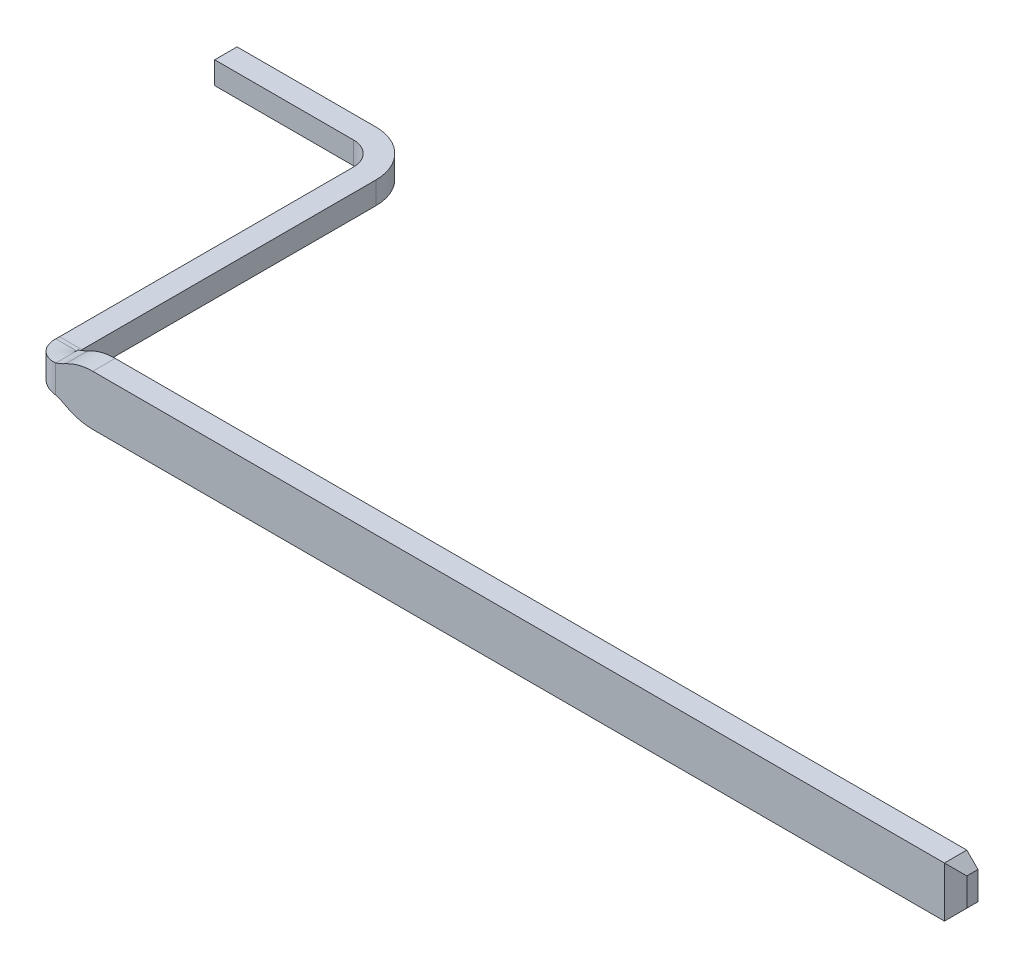
ISO-10303-21;
HEADER;
FILE_DESCRIPTION(('STEP AP214'),'2;1');
FILE_NAME('part.step','',(''),(''),'','','');
FILE_SCHEMA(('AUTOMOTIVE_DESIGN { 1 0 10303 214 1 1 1 1 }'));
ENDSEC;
DATA;
#1=APPLICATION_CONTEXT('core data for automotive mechanical design processes');
#2=APPLICATION_PROTOCOL_DEFINITION('international standard','automotive_design',2000,#1);
#3=PRODUCT_CONTEXT('',#1,'mechanical');
#4=PRODUCT('Part','Part','',(#3));
#5=PRODUCT_RELATED_PRODUCT_CATEGORY('part','',(#4));
#6=PRODUCT_DEFINITION_FORMATION('','',#4);
#7=PRODUCT_DEFINITION_CONTEXT('part definition',#1,'design');
#8=PRODUCT_DEFINITION('design','',#6,#7);
#9=PRODUCT_DEFINITION_SHAPE('','',#8);
#10=(LENGTH_UNIT() NAMED_UNIT(*) SI_UNIT(.MILLI.,.METRE.));
#11=(NAMED_UNIT(*) PLANE_ANGLE_UNIT() SI_UNIT($,.RADIAN.));
#12=(NAMED_UNIT(*) SI_UNIT($,.STERADIAN.) SOLID_ANGLE_UNIT());
#13=UNCERTAINTY_MEASURE_WITH_UNIT(LENGTH_MEASURE(1.E-05),#10,'distance_accuracy_value','');
#14=(GEOMETRIC_REPRESENTATION_CONTEXT(3) GLOBAL_UNCERTAINTY_ASSIGNED_CONTEXT((#13)) GLOBAL_UNIT_ASSIGNED_CONTEXT((#10,
#11,#12)) REPRESENTATION_CONTEXT('',''));
#15=CARTESIAN_POINT('',(0.,0.,0.));
#16=DIRECTION('',(0.,0.,1.));
#17=DIRECTION('',(1.,0.,0.));
#18=AXIS2_PLACEMENT_3D('',#15,#16,#17);
#19=CARTESIAN_POINT('',(-4.44,0.225,-2.87));
#20=DIRECTION('',(0.,1.,0.));
#21=DIRECTION('',(0.,0.,1.));
#22=AXIS2_PLACEMENT_3D('',#19,#20,#21);
#23=CYLINDRICAL_SURFACE('',#22,0.21);
#24=CARTESIAN_POINT('',(-4.44,0.1,-2.87));
#25=DIRECTION('',(0.,1.,0.));
#26=DIRECTION('',(0.,0.,1.));
#27=AXIS2_PLACEMENT_3D('',#24,#25,#26);
#28=CIRCLE('',#27,0.21);
#29=CARTESIAN_POINT('',(-4.44,0.1,-3.08));
#30=VERTEX_POINT('',#29);
#31=CARTESIAN_POINT('',(-4.23,0.1,-2.87));
#32=VERTEX_POINT('',#31);
#33=EDGE_CURVE('E299',#30,#32,#28,.F.);
#34=ORIENTED_EDGE('',*,*,#33,.F.);
#35=DIRECTION('',(0.,1.,0.));
#36=VECTOR('',#35,1.);
#37=CARTESIAN_POINT('',(-4.44,0.225,-3.08));
#38=LINE('',#37,#36);
#39=CARTESIAN_POINT('',(-4.44,-0.1,-3.08));
#40=VERTEX_POINT('',#39);
#41=EDGE_CURVE('E319',#40,#30,#38,.T.);
#42=ORIENTED_EDGE('',*,*,#41,.F.);
#43=CARTESIAN_POINT('',(-4.44,-0.1,-2.87));
#44=DIRECTION('',(0.,1.,0.));
#45=DIRECTION('',(0.,0.,1.));
#46=AXIS2_PLACEMENT_3D('',#43,#44,#45);
#47=CIRCLE('',#46,0.21);
#48=CARTESIAN_POINT('',(-4.23,-0.1,-2.87));
#49=VERTEX_POINT('',#48);
#50=EDGE_CURVE('E306',#40,#49,#47,.F.);
#51=ORIENTED_EDGE('',*,*,#50,.T.);
#52=DIRECTION('',(0.,1.,0.));
#53=VECTOR('',#52,1.);
#54=CARTESIAN_POINT('',(-4.23,0.225,-2.87));
#55=LINE('',#54,#53);
#56=EDGE_CURVE('E188',#32,#49,#55,.F.);
#57=ORIENTED_EDGE('',*,*,#56,.F.);
#58=EDGE_LOOP('',(#34,#42,#51,#57));
#59=FACE_BOUND('',#58,.T.);
#60=ADVANCED_FACE('F16',(#59),#23,.F.);
#61=CARTESIAN_POINT('',(-4.23,0.225,-0.21));
#62=DIRECTION('',(-1.,0.,0.));
#63=DIRECTION('',(0.,0.,1.));
#64=AXIS2_PLACEMENT_3D('',#61,#62,#63);
#65=PLANE('',#64);
#66=DIRECTION('',(0.,0.,1.));
#67=VECTOR('',#66,1.);
#68=CARTESIAN_POINT('',(-4.23,-0.1,-10.2494341307216));
#69=LINE('',#68,#67);
#70=CARTESIAN_POINT('',(-4.23,-0.1,-0.244023483556444));
#71=VERTEX_POINT('',#70);
#72=EDGE_CURVE('E305',#49,#71,#69,.T.);
#73=ORIENTED_EDGE('',*,*,#72,.T.);
#74=CARTESIAN_POINT('',(-4.23,-0.6,-0.244023483556444));
#75=DIRECTION('',(-1.,0.,0.));
#76=DIRECTION('',(0.,0.,1.));
#77=AXIS2_PLACEMENT_3D('',#74,#75,#76);
#78=CIRCLE('',#77,0.5);
#79=CARTESIAN_POINT('',(-4.23,-0.101158940576576,-0.21));
#80=VERTEX_POINT('',#79);
#81=EDGE_CURVE('E161',#71,#80,#78,.F.);
#82=ORIENTED_EDGE('',*,*,#81,.T.);
#83=DIRECTION('',(0.,1.,0.));
#84=VECTOR('',#83,1.);
#85=CARTESIAN_POINT('',(-4.23,0.225,-0.21));
#86=LINE('',#85,#84);
#87=CARTESIAN_POINT('',(-4.23,0.101158940576575,-0.21));
#88=VERTEX_POINT('',#87);
#89=EDGE_CURVE('E154',#80,#88,#86,.T.);
#90=ORIENTED_EDGE('',*,*,#89,.T.);
#91=CARTESIAN_POINT('',(-4.23,0.6,-0.244023483556443));
#92=DIRECTION('',(-1.,0.,0.));
#93=DIRECTION('',(0.,0.,1.));
#94=AXIS2_PLACEMENT_3D('',#91,#92,#93);
#95=CIRCLE('',#94,0.5);
#96=CARTESIAN_POINT('',(-4.23,0.1,-0.244023483556443));
#97=VERTEX_POINT('',#96);
#98=EDGE_CURVE('E23',#88,#97,#95,.F.);
#99=ORIENTED_EDGE('',*,*,#98,.T.);
#100=DIRECTION('',(0.,0.,1.));
#101=VECTOR('',#100,1.);
#102=CARTESIAN_POINT('',(-4.23,0.1,-10.2494341307216));
#103=LINE('',#102,#101);
#104=EDGE_CURVE('E298',#32,#97,#103,.T.);
#105=ORIENTED_EDGE('',*,*,#104,.F.);
#106=ORIENTED_EDGE('',*,*,#56,.T.);
#107=EDGE_LOOP('',(#73,#82,#90,#99,#105,#106));
#108=FACE_BOUND('',#107,.T.);
#109=ADVANCED_FACE('F157',(#108),#65,.T.);
#110=CARTESIAN_POINT('',(-4.44,0.225,-3.28));
#111=DIRECTION('',(0.,0.,1.));
#112=DIRECTION('',(1.,0.,0.));
#113=AXIS2_PLACEMENT_3D('',#110,#111,#112);
#114=PLANE('',#113);
#115=DIRECTION('',(0.,1.,0.));
#116=VECTOR('',#115,1.);
#117=CARTESIAN_POINT('',(-4.44,0.225,-3.28));
#118=LINE('',#117,#116);
#119=CARTESIAN_POINT('',(-4.44,-0.1,-3.28));
#120=VERTEX_POINT('',#119);
#121=CARTESIAN_POINT('',(-4.44,0.1,-3.28));
#122=VERTEX_POINT('',#121);
#123=EDGE_CURVE('E195',#120,#122,#118,.T.);
#124=ORIENTED_EDGE('',*,*,#123,.F.);
#125=DIRECTION('',(1.,0.,0.));
#126=VECTOR('',#125,1.);
#127=CARTESIAN_POINT('',(-4.02,-0.1,-3.28));
#128=LINE('',#127,#126);
#129=CARTESIAN_POINT('',(-5.68,-0.1,-3.28));
#130=VERTEX_POINT('',#129);
#131=EDGE_CURVE('E301',#120,#130,#128,.F.);
#132=ORIENTED_EDGE('',*,*,#131,.T.);
#133=DIRECTION('',(0.,1.,0.));
#134=VECTOR('',#133,1.);
#135=CARTESIAN_POINT('',(-5.68,0.225,-3.28));
#136=LINE('',#135,#134);
#137=CARTESIAN_POINT('',(-5.68,0.1,-3.28));
#138=VERTEX_POINT('',#137);
#139=EDGE_CURVE('E192',#138,#130,#136,.F.);
#140=ORIENTED_EDGE('',*,*,#139,.F.);
#141=DIRECTION('',(1.,0.,0.));
#142=VECTOR('',#141,1.);
#143=CARTESIAN_POINT('',(-4.02,0.1,-3.28));
#144=LINE('',#143,#142);
#145=EDGE_CURVE('E297',#122,#138,#144,.F.);
#146=ORIENTED_EDGE('',*,*,#145,.F.);
#147=EDGE_LOOP('',(#124,#132,#140,#146));
#148=FACE_BOUND('',#147,.T.);
#149=ADVANCED_FACE('F343',(#148),#114,.F.);
#150=CARTESIAN_POINT('',(-5.68,0.225,-3.08));
#151=DIRECTION('',(-1.,0.,0.));
#152=DIRECTION('',(0.,0.,1.));
#153=AXIS2_PLACEMENT_3D('',#150,#151,#152);
#154=PLANE('',#153);
#155=ORIENTED_EDGE('',*,*,#139,.T.);
#156=DIRECTION('',(0.,0.,1.));
#157=VECTOR('',#156,1.);
#158=CARTESIAN_POINT('',(-5.68,-0.1,-10.2494341307216));
#159=LINE('',#158,#157);
#160=CARTESIAN_POINT('',(-5.68,-0.1,-3.08));
#161=VERTEX_POINT('',#160);
#162=EDGE_CURVE('E197',#130,#161,#159,.T.);
#163=ORIENTED_EDGE('',*,*,#162,.T.);
#164=DIRECTION('',(0.,1.,0.));
#165=VECTOR('',#164,1.);
#166=CARTESIAN_POINT('',(-5.68,0.225,-3.08));
#167=LINE('',#166,#165);
#168=CARTESIAN_POINT('',(-5.68,0.1,-3.08));
#169=VERTEX_POINT('',#168);
#170=EDGE_CURVE('E321',#169,#161,#167,.F.);
#171=ORIENTED_EDGE('',*,*,#170,.F.);
#172=DIRECTION('',(0.,0.,1.));
#173=VECTOR('',#172,1.);
#174=CARTESIAN_POINT('',(-5.68,0.1,-10.2494341307216));
#175=LINE('',#174,#173);
#176=EDGE_CURVE('E325',#138,#169,#175,.T.);
#177=ORIENTED_EDGE('',*,*,#176,.F.);
#178=EDGE_LOOP('',(#155,#163,#171,#177));
#179=FACE_BOUND('',#178,.T.);
#180=ADVANCED_FACE('F335',(#179),#154,.T.);
#181=CARTESIAN_POINT('',(-4.44,0.225,-3.08));
#182=DIRECTION('',(0.,0.,1.));
#183=DIRECTION('',(1.,0.,0.));
#184=AXIS2_PLACEMENT_3D('',#181,#182,#183);
#185=PLANE('',#184);
#186=ORIENTED_EDGE('',*,*,#170,.T.);
#187=DIRECTION('',(1.,0.,0.));
#188=VECTOR('',#187,1.);
#189=CARTESIAN_POINT('',(-4.02,-0.1,-3.08));
#190=LINE('',#189,#188);
#191=EDGE_CURVE('E200',#161,#40,#190,.T.);
#192=ORIENTED_EDGE('',*,*,#191,.T.);
#193=ORIENTED_EDGE('',*,*,#41,.T.);
#194=DIRECTION('',(1.,0.,0.));
#195=VECTOR('',#194,1.);
#196=CARTESIAN_POINT('',(-4.02,0.1,-3.08));
#197=LINE('',#196,#195);
#198=EDGE_CURVE('E327',#169,#30,#197,.T.);
#199=ORIENTED_EDGE('',*,*,#198,.F.);
#200=EDGE_LOOP('',(#186,#192,#193,#199));
#201=FACE_BOUND('',#200,.T.);
#202=ADVANCED_FACE('F681',(#201),#185,.T.);
#203=CARTESIAN_POINT('',(-4.44,0.225,-2.87));
#204=DIRECTION('',(0.,1.,0.));
#205=DIRECTION('',(0.,0.,1.));
#206=AXIS2_PLACEMENT_3D('',#203,#204,#205);
#207=CYLINDRICAL_SURFACE('',#206,0.41);
#208=DIRECTION('',(0.,1.,0.));
#209=VECTOR('',#208,1.);
#210=CARTESIAN_POINT('',(-4.03,0.225,-2.87));
#211=LINE('',#210,#209);
#212=CARTESIAN_POINT('',(-4.03,0.1,-2.87));
#213=VERTEX_POINT('',#212);
#214=CARTESIAN_POINT('',(-4.03,-0.1,-2.87));
#215=VERTEX_POINT('',#214);
#216=EDGE_CURVE('E349',#213,#215,#211,.F.);
#217=ORIENTED_EDGE('',*,*,#216,.T.);
#218=CARTESIAN_POINT('',(-4.44,-0.1,-2.87));
#219=DIRECTION('',(0.,1.,0.));
#220=DIRECTION('',(0.,0.,1.));
#221=AXIS2_PLACEMENT_3D('',#218,#219,#220);
#222=CIRCLE('',#221,0.41);
#223=EDGE_CURVE('E302',#215,#120,#222,.T.);
#224=ORIENTED_EDGE('',*,*,#223,.T.);
#225=ORIENTED_EDGE('',*,*,#123,.T.);
#226=CARTESIAN_POINT('',(-4.44,0.1,-2.87));
#227=DIRECTION('',(0.,1.,0.));
#228=DIRECTION('',(0.,0.,1.));
#229=AXIS2_PLACEMENT_3D('',#226,#227,#228);
#230=CIRCLE('',#229,0.41);
#231=EDGE_CURVE('E294',#213,#122,#230,.T.);
#232=ORIENTED_EDGE('',*,*,#231,.F.);
#233=EDGE_LOOP('',(#217,#224,#225,#232));
#234=FACE_BOUND('',#233,.T.);
#235=ADVANCED_FACE('F673',(#234),#207,.T.);
#236=CARTESIAN_POINT('',(-4.02,-0.1,-10.2494341307216));
#237=DIRECTION('',(0.,1.,0.));
#238=DIRECTION('',(0.,0.,1.));
#239=AXIS2_PLACEMENT_3D('',#236,#237,#238);
#240=PLANE('',#239);
#241=ORIENTED_EDGE('',*,*,#223,.F.);
#242=DIRECTION('',(0.,0.,1.));
#243=VECTOR('',#242,1.);
#244=CARTESIAN_POINT('',(-4.03,-0.1,-0.21));
#245=LINE('',#244,#243);
#246=CARTESIAN_POINT('',(-4.03,-0.1,-0.244023483556444));
#247=VERTEX_POINT('',#246);
#248=EDGE_CURVE('E293',#215,#247,#245,.T.);
#249=ORIENTED_EDGE('',*,*,#248,.T.);
#250=DIRECTION('',(1.,0.,0.));
#251=VECTOR('',#250,1.);
#252=CARTESIAN_POINT('',(-4.03,-0.0999999999999999,-0.244023483556444));
#253=LINE('',#252,#251);
#254=EDGE_CURVE('E350',#247,#71,#253,.F.);
#255=ORIENTED_EDGE('',*,*,#254,.T.);
#256=ORIENTED_EDGE('',*,*,#72,.F.);
#257=ORIENTED_EDGE('',*,*,#50,.F.);
#258=ORIENTED_EDGE('',*,*,#191,.F.);
#259=ORIENTED_EDGE('',*,*,#162,.F.);
#260=ORIENTED_EDGE('',*,*,#131,.F.);
#261=EDGE_LOOP('',(#241,#249,#255,#256,#257,#258,#259,#260));
#262=FACE_BOUND('',#261,.T.);
#263=ADVANCED_FACE('F342',(#262),#240,.F.);
#264=CARTESIAN_POINT('',(-4.02,0.1,-10.2494341307216));
#265=DIRECTION('',(0.,1.,0.));
#266=DIRECTION('',(0.,0.,1.));
#267=AXIS2_PLACEMENT_3D('',#264,#265,#266);
#268=PLANE('',#267);
#269=ORIENTED_EDGE('',*,*,#176,.T.);
#270=ORIENTED_EDGE('',*,*,#198,.T.);
#271=ORIENTED_EDGE('',*,*,#33,.T.);
#272=ORIENTED_EDGE('',*,*,#104,.T.);
#273=DIRECTION('',(1.,0.,0.));
#274=VECTOR('',#273,1.);
#275=CARTESIAN_POINT('',(-4.03,0.0999999999999999,-0.244023483556443));
#276=LINE('',#275,#274);
#277=CARTESIAN_POINT('',(-4.03,0.1,-0.244023483556443));
#278=VERTEX_POINT('',#277);
#279=EDGE_CURVE('E187',#97,#278,#276,.T.);
#280=ORIENTED_EDGE('',*,*,#279,.T.);
#281=DIRECTION('',(0.,0.,1.));
#282=VECTOR('',#281,1.);
#283=CARTESIAN_POINT('',(-4.03,0.1,-0.21));
#284=LINE('',#283,#282);
#285=EDGE_CURVE('E175',#278,#213,#284,.F.);
#286=ORIENTED_EDGE('',*,*,#285,.T.);
#287=ORIENTED_EDGE('',*,*,#231,.T.);
#288=ORIENTED_EDGE('',*,*,#145,.T.);
#289=EDGE_LOOP('',(#269,#270,#271,#272,#280,#286,#287,#288));
#290=FACE_BOUND('',#289,.T.);
#291=ADVANCED_FACE('F658',(#290),#268,.T.);
#292=CARTESIAN_POINT('',(-4.03,0.6,-0.244023483556443));
#293=DIRECTION('',(1.,0.,0.));
#294=DIRECTION('',(0.,0.,-1.));
#295=AXIS2_PLACEMENT_3D('',#292,#293,#294);
#296=CYLINDRICAL_SURFACE('',#295,0.5);
#297=DIRECTION('',(1.,0.,0.));
#298=VECTOR('',#297,1.);
#299=CARTESIAN_POINT('',(-4.13,0.101158940576575,-0.21));
#300=LINE('',#299,#298);
#301=CARTESIAN_POINT('',(-4.03,0.101158940576576,-0.21));
#302=VERTEX_POINT('',#301);
#303=EDGE_CURVE('E174',#88,#302,#300,.T.);
#304=ORIENTED_EDGE('',*,*,#303,.T.);
#305=CARTESIAN_POINT('',(-4.03,0.6,-0.244023483556443));
#306=DIRECTION('',(1.,0.,0.));
#307=DIRECTION('',(0.,0.,-1.));
#308=AXIS2_PLACEMENT_3D('',#305,#306,#307);
#309=CIRCLE('',#308,0.5);
#310=EDGE_CURVE('E288',#302,#278,#309,.T.);
#311=ORIENTED_EDGE('',*,*,#310,.T.);
#312=ORIENTED_EDGE('',*,*,#279,.F.);
#313=ORIENTED_EDGE('',*,*,#98,.F.);
#314=EDGE_LOOP('',(#304,#311,#312,#313));
#315=FACE_BOUND('',#314,.T.);
#316=ADVANCED_FACE('F186',(#315),#296,.F.);
#317=CARTESIAN_POINT('',(-4.03,-0.6,-0.244023483556444));
#318=DIRECTION('',(1.,0.,0.));
#319=DIRECTION('',(0.,0.,-1.));
#320=AXIS2_PLACEMENT_3D('',#317,#318,#319);
#321=CYLINDRICAL_SURFACE('',#320,0.5);
#322=ORIENTED_EDGE('',*,*,#81,.F.);
#323=ORIENTED_EDGE('',*,*,#254,.F.);
#324=CARTESIAN_POINT('',(-4.03,-0.6,-0.244023483556444));
#325=DIRECTION('',(1.,0.,0.));
#326=DIRECTION('',(0.,0.,-1.));
#327=AXIS2_PLACEMENT_3D('',#324,#325,#326);
#328=CIRCLE('',#327,0.5);
#329=CARTESIAN_POINT('',(-4.03,-0.101158940576576,-0.21));
#330=VERTEX_POINT('',#329);
#331=EDGE_CURVE('E290',#247,#330,#328,.T.);
#332=ORIENTED_EDGE('',*,*,#331,.T.);
#333=DIRECTION('',(-1.,0.,0.));
#334=VECTOR('',#333,1.);
#335=CARTESIAN_POINT('',(-4.13,-0.101158940576576,-0.21));
#336=LINE('',#335,#334);
#337=EDGE_CURVE('E366',#330,#80,#336,.T.);
#338=ORIENTED_EDGE('',*,*,#337,.T.);
#339=EDGE_LOOP('',(#322,#323,#332,#338));
#340=FACE_BOUND('',#339,.T.);
#341=ADVANCED_FACE('F274',(#340),#321,.F.);
#342=CARTESIAN_POINT('',(-4.02,0.124114287421615,-0.21));
#343=DIRECTION('',(0.,1.,0.));
#344=DIRECTION('',(0.,0.,1.));
#345=AXIS2_PLACEMENT_3D('',#342,#343,#344);
#346=CYLINDRICAL_SURFACE('',#345,0.21);
#347=CARTESIAN_POINT('',(-4.23,-0.101158940576576,-0.21));
#348=CARTESIAN_POINT('',(-4.23000743010832,-0.101432143521485,-0.198933640139197));
#349=CARTESIAN_POINT('',(-4.22912563143157,-0.101753788118606,-0.187871914191268));
#350=CARTESIAN_POINT('',(-4.22564052790241,-0.102494150116234,-0.166029420329182));
#351=CARTESIAN_POINT('',(-4.22303773419751,-0.102912838670037,-0.155248569980906));
#352=CARTESIAN_POINT('',(-4.21593880710557,-0.103878761255174,-0.133532967634879));
#353=CARTESIAN_POINT('',(-4.21132814720644,-0.10443269811771,-0.12263576412296));
#354=CARTESIAN_POINT('',(-4.20034981438912,-0.105653272090144,-0.101774121437816));
#355=CARTESIAN_POINT('',(-4.19398219688327,-0.106319905645467,-0.0918096528605186));
#356=CARTESIAN_POINT('',(-4.17966175840868,-0.107767664053715,-0.0730791725025908));
#357=CARTESIAN_POINT('',(-4.17170659007844,-0.108548957986003,-0.0643149681879857));
#358=CARTESIAN_POINT('',(-4.15444597240556,-0.110227966453596,-0.0482493296178194));
#359=CARTESIAN_POINT('',(-4.14514050700143,-0.111125682373702,-0.0409479127642524));
#360=CARTESIAN_POINT('',(-4.12542290474164,-0.113038908655183,-0.0279958037194465));
#361=CARTESIAN_POINT('',(-4.11500810813162,-0.114054702680234,-0.0223492064102144));
#362=CARTESIAN_POINT('',(-4.09338979990316,-0.116203539406513,-0.0128883413426556));
#363=CARTESIAN_POINT('',(-4.08218658412984,-0.117336538202223,-0.00907339043950609));
#364=CARTESIAN_POINT('',(-4.06245097792108,-0.119396475163932,-0.0041572577298019));
#365=CARTESIAN_POINT('',(-4.05402632869541,-0.120294997774586,-0.00259919323725979));
#366=CARTESIAN_POINT('',(-4.0370675210368,-0.122156058131222,-0.000520226523125556));
#367=CARTESIAN_POINT('',(-4.02853350798701,-0.123118516826998,1.93269818358521E-06));
#368=CARTESIAN_POINT('',(-4.02,-0.124114287421615,0.));
#369=B_SPLINE_CURVE_WITH_KNOTS('',3,(#347,#348,#349,#350,#351,#352,#353,#354,#355,#356,#357,
#358,#359,#360,#361,#362,#363,#364,#365,#366,#367,#368),.UNSPECIFIED.,.F.,.F.,(4,2,2,2,2,2,2,2,
2,2,4),(0.,0.0331684575894302,0.0663270683382791,0.101693505249391,0.137058826872838,
0.172476832553552,0.207895259558179,0.243400604090516,0.27889269597184,0.304675789652125,
0.330427578140949),.UNSPECIFIED.);
#370=CARTESIAN_POINT('',(-4.02,-0.124114287421616,0.));
#371=VERTEX_POINT('',#370);
#372=EDGE_CURVE('E183',#80,#371,#369,.T.);
#373=ORIENTED_EDGE('',*,*,#372,.T.);
#374=DIRECTION('',(0.,1.,0.));
#375=VECTOR('',#374,1.);
#376=CARTESIAN_POINT('',(-4.02,0.225,0.));
#377=LINE('',#376,#375);
#378=CARTESIAN_POINT('',(-4.02,0.124114287421614,0.));
#379=VERTEX_POINT('',#378);
#380=EDGE_CURVE('E170',#379,#371,#377,.F.);
#381=ORIENTED_EDGE('',*,*,#380,.F.);
#382=CARTESIAN_POINT('',(-4.02,0.124114287421615,0.));
#383=CARTESIAN_POINT('',(-4.03190337540096,0.122725056595807,1.07018473565685E-05));
#384=CARTESIAN_POINT('',(-4.04381203209826,0.121400509160792,-0.00101147489141595));
#385=CARTESIAN_POINT('',(-4.06729157703391,0.118877968036939,-0.00505099537595338));
#386=CARTESIAN_POINT('',(-4.0788626933557,0.117679887387664,-0.00806695766416194));
#387=CARTESIAN_POINT('',(-4.10128660398396,0.115410577697545,-0.016006061210853));
#388=CARTESIAN_POINT('',(-4.11214234585603,0.114338811635387,-0.0209207180855486));
#389=CARTESIAN_POINT('',(-4.13287400195197,0.112312711813778,-0.0325164671303216));
#390=CARTESIAN_POINT('',(-4.14275015617343,0.111358349276795,-0.0391971251552287));
#391=CARTESIAN_POINT('',(-4.16120450981132,0.109571715171886,-0.0541104569130387));
#392=CARTESIAN_POINT('',(-4.16978727266918,0.108739014679495,-0.0623374322847382));
#393=CARTESIAN_POINT('',(-4.18544825589962,0.107188897709081,-0.080125972775488));
#394=CARTESIAN_POINT('',(-4.1925265397612,0.106471476366591,-0.0896874815490359));
#395=CARTESIAN_POINT('',(-4.20495645643552,0.105153273163319,-0.109845042283391));
#396=CARTESIAN_POINT('',(-4.21031254771358,0.104552191752345,-0.120438328872899));
#397=CARTESIAN_POINT('',(-4.21916536312806,0.103462342252806,-0.142377202368875));
#398=CARTESIAN_POINT('',(-4.2226633142977,0.102973500167788,-0.153722287239162));
#399=CARTESIAN_POINT('',(-4.22678339685296,0.10226512308797,-0.172619901633766));
#400=CARTESIAN_POINT('',(-4.22798890782219,0.102012341979516,-0.180049121666497));
#401=CARTESIAN_POINT('',(-4.22959701992659,0.101551985369659,-0.19498430284126));
#402=CARTESIAN_POINT('',(-4.23000079390623,0.101344344230797,-0.2024901357152));
#403=CARTESIAN_POINT('',(-4.23,0.101158940576575,-0.21));
#404=B_SPLINE_CURVE_WITH_KNOTS('',3,(#382,#383,#384,#385,#386,#387,#388,#389,#390,#391,#392,
#393,#394,#395,#396,#397,#398,#399,#400,#401,#402,#403),.UNSPECIFIED.,.F.,.F.,(4,2,2,2,2,2,2,2,
2,2,4),(0.,0.035905666971063,0.0717864816006473,0.107508782224781,0.143222309205243,
0.178806720179375,0.214389629193847,0.249879664203142,0.285346233943266,0.307898040963291,
0.330416833033264),.UNSPECIFIED.);
#405=EDGE_CURVE('E167',#379,#88,#404,.T.);
#406=ORIENTED_EDGE('',*,*,#405,.T.);
#407=ORIENTED_EDGE('',*,*,#89,.F.);
#408=EDGE_LOOP('',(#373,#381,#406,#407));
#409=FACE_BOUND('',#408,.T.);
#410=ADVANCED_FACE('F169',(#409),#346,.T.);
#411=CARTESIAN_POINT('',(-4.03,0.225,-0.21));
#412=DIRECTION('',(-1.,0.,0.));
#413=DIRECTION('',(0.,0.,1.));
#414=AXIS2_PLACEMENT_3D('',#411,#412,#413);
#415=PLANE('',#414);
#416=ORIENTED_EDGE('',*,*,#310,.F.);
#417=DIRECTION('',(0.,1.,0.));
#418=VECTOR('',#417,1.);
#419=CARTESIAN_POINT('',(-4.03,0.124114287421615,-0.21));
#420=LINE('',#419,#418);
#421=EDGE_CURVE('E405',#302,#330,#420,.F.);
#422=ORIENTED_EDGE('',*,*,#421,.T.);
#423=ORIENTED_EDGE('',*,*,#331,.F.);
#424=ORIENTED_EDGE('',*,*,#248,.F.);
#425=ORIENTED_EDGE('',*,*,#216,.F.);
#426=ORIENTED_EDGE('',*,*,#285,.F.);
#427=EDGE_LOOP('',(#416,#422,#423,#424,#425,#426));
#428=FACE_BOUND('',#427,.T.);
#429=ADVANCED_FACE('F267',(#428),#415,.F.);
#430=CARTESIAN_POINT('',(-4.23202,0.101158940576575,-0.21));
#431=CARTESIAN_POINT('',(-4.23202,0.102546659833655,-0.153239739674804));
#432=CARTESIAN_POINT('',(-4.20824043701283,0.105159533267918,-0.0976865496137367));
#433=CARTESIAN_POINT('',(-4.12882573797228,0.112830289181848,-0.0197219612797117));
#434=CARTESIAN_POINT('',(-4.07400092677609,0.117874406004369,0.00201999999999993));
#435=CARTESIAN_POINT('',(-4.02,0.124114287421615,0.00202));
#436=CARTESIAN_POINT('',(-4.23,0.101158940576575,-0.21));
#437=CARTESIAN_POINT('',(-4.23,0.102546646790206,-0.153780542476827));
#438=CARTESIAN_POINT('',(-4.20644699449436,0.105159533267918,-0.098756605126331));
#439=CARTESIAN_POINT('',(-4.12778891130166,0.112830289181848,-0.0215348168509549));
#440=CARTESIAN_POINT('',(-4.07348641177817,0.117874471308925,0.));
#441=CARTESIAN_POINT('',(-4.02,0.124114287421615,0.));
#442=CARTESIAN_POINT('',(-4.03,0.101158940576575,-0.21));
#443=CARTESIAN_POINT('',(-4.03,0.102545355359649,-0.207325374360293));
#444=CARTESIAN_POINT('',(-4.02887842830925,0.105159533267918,-0.204702695482207));
#445=CARTESIAN_POINT('',(-4.02513280530008,0.112830289181848,-0.201025467469093));
#446=CARTESIAN_POINT('',(-4.02254433277619,0.117880937106508,-0.2));
#447=CARTESIAN_POINT('',(-4.02,0.124114287421615,-0.2));
#448=CARTESIAN_POINT('',(-4.028,0.101158940576575,-0.21));
#449=CARTESIAN_POINT('',(-4.028,0.102545342445343,-0.207860822679128));
#450=CARTESIAN_POINT('',(-4.0271027426474,0.105159533267918,-0.205762156385766));
#451=CARTESIAN_POINT('',(-4.02410624424006,0.112830289181848,-0.202820373975274));
#452=CARTESIAN_POINT('',(-4.02203491198617,0.117881001764484,-0.202));
#453=CARTESIAN_POINT('',(-4.02,0.124114287421615,-0.202));
#454=B_SPLINE_SURFACE_WITH_KNOTS('',1,3,((#430,#431,#432,#433,#434,#435),(#436,#437,#438,#439,
#440,#441),(#442,#443,#444,#445,#446,#447),(#448,#449,#450,#451,#452,#453)),.UNSPECIFIED.,.F.,
.F.,.F.,(2,1,1,2),(4,2,4),(-0.0101,0.,1.,1.01),(4.78048857121855,4.90235751287474,
5.02422645453093),.UNSPECIFIED.);
#455=CARTESIAN_POINT('',(-4.02,0.124114287421615,-0.2));
#456=CARTESIAN_POINT('',(-4.02085662865134,0.121995186733768,-0.200007568679163));
#457=CARTESIAN_POINT('',(-4.02178641422411,0.119887550096803,-0.200113479961398));
#458=CARTESIAN_POINT('',(-4.02371982760732,0.115708139988861,-0.200659361459678));
#459=CARTESIAN_POINT('',(-4.02472447236866,0.113637664937403,-0.201105221318472));
#460=CARTESIAN_POINT('',(-4.02664864629132,0.109725298998943,-0.202443179843877));
#461=CARTESIAN_POINT('',(-4.02756991402892,0.107877147686326,-0.203311677121211));
#462=CARTESIAN_POINT('',(-4.02889488171605,0.104976098905077,-0.205325776933997));
#463=CARTESIAN_POINT('',(-4.02937060540025,0.103853531185739,-0.206303772375835));
#464=CARTESIAN_POINT('',(-4.0298708360797,0.102230685837629,-0.208222653476669));
#465=CARTESIAN_POINT('',(-4.02999211124695,0.10164702604904,-0.209070714091166));
#466=CARTESIAN_POINT('',(-4.03,0.101158940576575,-0.21));
#467=B_SPLINE_CURVE_WITH_KNOTS('',3,(#455,#456,#457,#458,#459,#460,#461,#462,#463,#464,#465,
#466),.UNSPECIFIED.,.F.,.F.,(4,2,2,2,2,4),(0.,0.00688086146012702,0.0138837220807244,
0.0205339465220933,0.0251369702778051,0.0282318755787238),.UNSPECIFIED.);
#468=CARTESIAN_POINT('',(-4.02,0.124114287421614,-0.2));
#469=VERTEX_POINT('',#468);
#470=EDGE_CURVE('E180',#469,#302,#467,.T.);
#471=DIRECTION('',(0.,0.,-1.));
#472=VECTOR('',#471,1.);
#473=CARTESIAN_POINT('',(-4.02,0.124114287421614,-0.2));
#474=LINE('',#473,#472);
#475=EDGE_CURVE('E403',#379,#469,#474,.T.);
#476=ORIENTED_EDGE('',*,*,#470,.T.);
#477=ORIENTED_EDGE('',*,*,#303,.F.);
#478=ORIENTED_EDGE('',*,*,#405,.F.);
#479=ORIENTED_EDGE('',*,*,#475,.T.);
#480=EDGE_LOOP('',(#476,#477,#478,#479));
#481=FACE_BOUND('',#480,.T.);
#482=ADVANCED_FACE('F179',(#481),#454,.F.);
#483=CARTESIAN_POINT('',(-4.02,-0.124114287421615,0.00202));
#484=CARTESIAN_POINT('',(-4.07400092677608,-0.117874406004369,0.00201999999999998));
#485=CARTESIAN_POINT('',(-4.12882573797228,-0.112830289181849,-0.0197219612797102));
#486=CARTESIAN_POINT('',(-4.20824043701283,-0.105159533267918,-0.0976865496137339));
#487=CARTESIAN_POINT('',(-4.23202,-0.102546659833655,-0.153239739674803));
#488=CARTESIAN_POINT('',(-4.23202,-0.101158940576576,-0.21));
#489=CARTESIAN_POINT('',(-4.02,-0.124114287421615,0.));
#490=CARTESIAN_POINT('',(-4.07348641177816,-0.117874471308925,0.));
#491=CARTESIAN_POINT('',(-4.12778891130166,-0.112830289181849,-0.0215348168509534));
#492=CARTESIAN_POINT('',(-4.20644699449436,-0.105159533267918,-0.0987566051263283));
#493=CARTESIAN_POINT('',(-4.23,-0.102546646790206,-0.153780542476826));
#494=CARTESIAN_POINT('',(-4.23,-0.101158940576576,-0.21));
#495=CARTESIAN_POINT('',(-4.02,-0.124114287421615,-0.2));
#496=CARTESIAN_POINT('',(-4.02254433277619,-0.117880937106508,-0.2));
#497=CARTESIAN_POINT('',(-4.02513280530008,-0.112830289181849,-0.201025467469093));
#498=CARTESIAN_POINT('',(-4.02887842830925,-0.105159533267918,-0.204702695482207));
#499=CARTESIAN_POINT('',(-4.03,-0.102545355359649,-0.207325374360293));
#500=CARTESIAN_POINT('',(-4.03,-0.101158940576576,-0.21));
#501=CARTESIAN_POINT('',(-4.02,-0.124114287421615,-0.202));
#502=CARTESIAN_POINT('',(-4.02203491198617,-0.117881001764484,-0.202));
#503=CARTESIAN_POINT('',(-4.02410624424006,-0.112830289181849,-0.202820373975274));
#504=CARTESIAN_POINT('',(-4.0271027426474,-0.105159533267918,-0.205762156385766));
#505=CARTESIAN_POINT('',(-4.028,-0.102545342445343,-0.207860822679128));
#506=CARTESIAN_POINT('',(-4.028,-0.101158940576576,-0.21));
#507=B_SPLINE_SURFACE_WITH_KNOTS('',1,3,((#483,#484,#485,#486,#487,#488),(#489,#490,#491,#492,
#493,#494),(#495,#496,#497,#498,#499,#500),(#501,#502,#503,#504,#505,#506)),.UNSPECIFIED.,.F.,
.F.,.F.,(2,1,1,2),(4,2,4),(-0.0101,0.,1.,1.01),(1.25895885264865,1.38082779430484,
1.50269673596104),.UNSPECIFIED.);
#508=CARTESIAN_POINT('',(-4.03,-0.101158940576576,-0.21));
#509=CARTESIAN_POINT('',(-4.02998180998836,-0.101780615773462,-0.208828718818235));
#510=CARTESIAN_POINT('',(-4.02979598705017,-0.102540510662379,-0.207792425053747));
#511=CARTESIAN_POINT('',(-4.02908418914379,-0.10459425837617,-0.205592237903467));
#512=CARTESIAN_POINT('',(-4.02845158678957,-0.10597999398299,-0.204544208307881));
#513=CARTESIAN_POINT('',(-4.02658757347885,-0.109894510925843,-0.202249088426792));
#514=CARTESIAN_POINT('',(-4.025244442235,-0.112551472049058,-0.20136486528882));
#515=CARTESIAN_POINT('',(-4.02324679134848,-0.116722178904259,-0.200513445244303));
#516=CARTESIAN_POINT('',(-4.02256383908056,-0.118189815791255,-0.200310800059921));
#517=CARTESIAN_POINT('',(-4.02124506121451,-0.121139111708642,-0.200055242579584));
#518=CARTESIAN_POINT('',(-4.02060878372263,-0.122620414997679,-0.20000063396611));
#519=CARTESIAN_POINT('',(-4.02,-0.124114287421615,-0.2));
#520=B_SPLINE_CURVE_WITH_KNOTS('',3,(#508,#509,#510,#511,#512,#513,#514,#515,#516,#517,#518,
#519),.UNSPECIFIED.,.F.,.F.,(4,2,2,2,2,4),(0.,0.00387441254926356,0.00930463351604767,
0.0184871539699757,0.023377759851906,0.0282120836784113),.UNSPECIFIED.);
#521=CARTESIAN_POINT('',(-4.02,-0.124114287421616,-0.2));
#522=VERTEX_POINT('',#521);
#523=EDGE_CURVE('E232',#330,#522,#520,.T.);
#524=DIRECTION('',(0.,0.,-1.));
#525=VECTOR('',#524,1.);
#526=CARTESIAN_POINT('',(-4.02,-0.124114287421617,-0.2));
#527=LINE('',#526,#525);
#528=EDGE_CURVE('E225',#522,#371,#527,.F.);
#529=ORIENTED_EDGE('',*,*,#523,.T.);
#530=ORIENTED_EDGE('',*,*,#528,.T.);
#531=ORIENTED_EDGE('',*,*,#372,.F.);
#532=ORIENTED_EDGE('',*,*,#337,.F.);
#533=EDGE_LOOP('',(#529,#530,#531,#532));
#534=FACE_BOUND('',#533,.T.);
#535=ADVANCED_FACE('F18',(#534),#507,.F.);
#536=CARTESIAN_POINT('',(4.02,0.225,-0.1));
#537=DIRECTION('',(0.707106781186547,0.,0.707106781186548));
#538=DIRECTION('',(0.707106781186548,0.,-0.707106781186547));
#539=AXIS2_PLACEMENT_3D('',#536,#537,#538);
#540=PLANE('',#539);
#541=DIRECTION('',(0.577350269189626,0.577350269189627,-0.577350269189624));
#542=VECTOR('',#541,1.);
#543=CARTESIAN_POINT('',(3.92,-0.225,0.));
#544=LINE('',#543,#542);
#545=CARTESIAN_POINT('',(3.92,-0.225,0.));
#546=VERTEX_POINT('',#545);
#547=CARTESIAN_POINT('',(4.02,-0.125,-0.1));
#548=VERTEX_POINT('',#547);
#549=EDGE_CURVE('E377',#546,#548,#544,.T.);
#550=ORIENTED_EDGE('',*,*,#549,.T.);
#551=DIRECTION('',(0.,1.,0.));
#552=VECTOR('',#551,1.);
#553=CARTESIAN_POINT('',(4.02,0.225,-0.1));
#554=LINE('',#553,#552);
#555=CARTESIAN_POINT('',(4.02,0.125,-0.1));
#556=VERTEX_POINT('',#555);
#557=EDGE_CURVE('E382',#548,#556,#554,.T.);
#558=ORIENTED_EDGE('',*,*,#557,.T.);
#559=DIRECTION('',(0.577350269189625,-0.577350269189629,-0.577350269189623));
#560=VECTOR('',#559,1.);
#561=CARTESIAN_POINT('',(3.92,0.225,0.));
#562=LINE('',#561,#560);
#563=CARTESIAN_POINT('',(3.92,0.225,0.));
#564=VERTEX_POINT('',#563);
#565=EDGE_CURVE('E385',#564,#556,#562,.T.);
#566=ORIENTED_EDGE('',*,*,#565,.F.);
#567=DIRECTION('',(0.,1.,0.));
#568=VECTOR('',#567,1.);
#569=CARTESIAN_POINT('',(3.92,0.225,0.));
#570=LINE('',#569,#568);
#571=EDGE_CURVE('E367',#546,#564,#570,.T.);
#572=ORIENTED_EDGE('',*,*,#571,.F.);
#573=EDGE_LOOP('',(#550,#558,#566,#572));
#574=FACE_BOUND('',#573,.T.);
#575=ADVANCED_FACE('F262',(#574),#540,.T.);
#576=CARTESIAN_POINT('',(4.02,0.225,0.));
#577=DIRECTION('',(0.,0.,1.));
#578=DIRECTION('',(1.,0.,0.));
#579=AXIS2_PLACEMENT_3D('',#576,#577,#578);
#580=PLANE('',#579);
#581=CARTESIAN_POINT('',(-4.17340400439286,-0.6,0.));
#582=DIRECTION('',(0.,0.,-1.));
#583=DIRECTION('',(-1.,0.,0.));
#584=AXIS2_PLACEMENT_3D('',#581,#582,#583);
#585=CIRCLE('',#584,0.5);
#586=CARTESIAN_POINT('',(-3.93134254525489,-0.162500000000001,0.));
#587=VERTEX_POINT('',#586);
#588=EDGE_CURVE('E223',#371,#587,#585,.T.);
#589=ORIENTED_EDGE('',*,*,#588,.T.);
#590=CARTESIAN_POINT('',(-3.68928108611693,0.275,0.));
#591=DIRECTION('',(0.,0.,-1.));
#592=DIRECTION('',(-1.,0.,0.));
#593=AXIS2_PLACEMENT_3D('',#590,#591,#592);
#594=CIRCLE('',#593,0.5);
#595=CARTESIAN_POINT('',(-3.68928108611693,-0.225,0.));
#596=VERTEX_POINT('',#595);
#597=EDGE_CURVE('E218',#596,#587,#594,.T.);
#598=ORIENTED_EDGE('',*,*,#597,.F.);
#599=DIRECTION('',(1.,0.,0.));
#600=VECTOR('',#599,1.);
#601=CARTESIAN_POINT('',(4.02,-0.225,0.));
#602=LINE('',#601,#600);
#603=EDGE_CURVE('E371',#596,#546,#602,.T.);
#604=ORIENTED_EDGE('',*,*,#603,.T.);
#605=ORIENTED_EDGE('',*,*,#571,.T.);
#606=DIRECTION('',(1.,0.,0.));
#607=VECTOR('',#606,1.);
#608=CARTESIAN_POINT('',(-4.44,0.225,0.));
#609=LINE('',#608,#607);
#610=CARTESIAN_POINT('',(-3.68928108611693,0.225,0.));
#611=VERTEX_POINT('',#610);
#612=EDGE_CURVE('E397',#611,#564,#609,.T.);
#613=ORIENTED_EDGE('',*,*,#612,.F.);
#614=CARTESIAN_POINT('',(-3.68928108611693,-0.275,0.));
#615=DIRECTION('',(0.,0.,1.));
#616=DIRECTION('',(1.,0.,0.));
#617=AXIS2_PLACEMENT_3D('',#614,#615,#616);
#618=CIRCLE('',#617,0.5);
#619=CARTESIAN_POINT('',(-3.93134254525489,0.1625,0.));
#620=VERTEX_POINT('',#619);
#621=EDGE_CURVE('E390',#620,#611,#618,.F.);
#622=ORIENTED_EDGE('',*,*,#621,.F.);
#623=CARTESIAN_POINT('',(-4.17340400439285,0.6,0.));
#624=DIRECTION('',(0.,0.,-1.));
#625=DIRECTION('',(-1.,0.,0.));
#626=AXIS2_PLACEMENT_3D('',#623,#624,#625);
#627=CIRCLE('',#626,0.5);
#628=EDGE_CURVE('E402',#620,#379,#627,.T.);
#629=ORIENTED_EDGE('',*,*,#628,.T.);
#630=ORIENTED_EDGE('',*,*,#380,.T.);
#631=EDGE_LOOP('',(#589,#598,#604,#605,#613,#622,#629,#630));
#632=FACE_BOUND('',#631,.T.);
#633=ADVANCED_FACE('F258',(#632),#580,.T.);
#634=CARTESIAN_POINT('',(-3.68928108611693,-0.275,-10.2494341307216));
#635=DIRECTION('',(0.,0.,1.));
#636=DIRECTION('',(1.,0.,0.));
#637=AXIS2_PLACEMENT_3D('',#634,#635,#636);
#638=CYLINDRICAL_SURFACE('',#637,0.5);
#639=ORIENTED_EDGE('',*,*,#621,.T.);
#640=DIRECTION('',(0.,0.,1.));
#641=VECTOR('',#640,1.);
#642=CARTESIAN_POINT('',(-3.68928108611693,0.225,-3.08));
#643=LINE('',#642,#641);
#644=CARTESIAN_POINT('',(-3.68928108611693,0.225,-0.2));
#645=VERTEX_POINT('',#644);
#646=EDGE_CURVE('E217',#645,#611,#643,.T.);
#647=ORIENTED_EDGE('',*,*,#646,.F.);
#648=CARTESIAN_POINT('',(-3.68928108611693,-0.275,-0.200000000000001));
#649=DIRECTION('',(0.,0.,1.));
#650=DIRECTION('',(1.,0.,0.));
#651=AXIS2_PLACEMENT_3D('',#648,#649,#650);
#652=CIRCLE('',#651,0.5);
#653=CARTESIAN_POINT('',(-3.93134254525489,0.162499999999999,-0.2));
#654=VERTEX_POINT('',#653);
#655=EDGE_CURVE('E214',#645,#654,#652,.T.);
#656=ORIENTED_EDGE('',*,*,#655,.T.);
#657=DIRECTION('',(0.,0.,-1.));
#658=VECTOR('',#657,1.);
#659=CARTESIAN_POINT('',(-3.93134254525489,0.162499999999999,-0.2));
#660=LINE('',#659,#658);
#661=EDGE_CURVE('E399',#654,#620,#660,.F.);
#662=ORIENTED_EDGE('',*,*,#661,.T.);
#663=EDGE_LOOP('',(#639,#647,#656,#662));
#664=FACE_BOUND('',#663,.T.);
#665=ADVANCED_FACE('F254',(#664),#638,.T.);
#666=CARTESIAN_POINT('',(-4.17340400439285,0.6,-0.2));
#667=DIRECTION('',(0.,0.,-1.));
#668=DIRECTION('',(-1.,0.,0.));
#669=AXIS2_PLACEMENT_3D('',#666,#667,#668);
#670=CYLINDRICAL_SURFACE('',#669,0.5);
#671=ORIENTED_EDGE('',*,*,#628,.F.);
#672=ORIENTED_EDGE('',*,*,#661,.F.);
#673=CARTESIAN_POINT('',(-4.17340400439285,0.6,-0.2));
#674=DIRECTION('',(0.,0.,-1.));
#675=DIRECTION('',(-1.,0.,0.));
#676=AXIS2_PLACEMENT_3D('',#673,#674,#675);
#677=CIRCLE('',#676,0.5);
#678=EDGE_CURVE('E211',#654,#469,#677,.T.);
#679=ORIENTED_EDGE('',*,*,#678,.T.);
#680=ORIENTED_EDGE('',*,*,#475,.F.);
#681=EDGE_LOOP('',(#671,#672,#679,#680));
#682=FACE_BOUND('',#681,.T.);
#683=ADVANCED_FACE('F248',(#682),#670,.F.);
#684=CARTESIAN_POINT('',(-4.02,0.124114287421615,-0.21));
#685=DIRECTION('',(0.,1.,0.));
#686=DIRECTION('',(0.,0.,1.));
#687=AXIS2_PLACEMENT_3D('',#684,#685,#686);
#688=CYLINDRICAL_SURFACE('',#687,0.01);
#689=DIRECTION('',(0.,1.,0.));
#690=VECTOR('',#689,1.);
#691=CARTESIAN_POINT('',(-4.02,0.225,-0.2));
#692=LINE('',#691,#690);
#693=EDGE_CURVE('E210',#469,#522,#692,.F.);
#694=ORIENTED_EDGE('',*,*,#693,.T.);
#695=ORIENTED_EDGE('',*,*,#523,.F.);
#696=ORIENTED_EDGE('',*,*,#421,.F.);
#697=ORIENTED_EDGE('',*,*,#470,.F.);
#698=EDGE_LOOP('',(#694,#695,#696,#697));
#699=FACE_BOUND('',#698,.T.);
#700=ADVANCED_FACE('F242',(#699),#688,.F.);
#701=CARTESIAN_POINT('',(-4.17340400439286,-0.6,-0.2));
#702=DIRECTION('',(0.,0.,-1.));
#703=DIRECTION('',(-1.,0.,0.));
#704=AXIS2_PLACEMENT_3D('',#701,#702,#703);
#705=CYLINDRICAL_SURFACE('',#704,0.5);
#706=ORIENTED_EDGE('',*,*,#528,.F.);
#707=CARTESIAN_POINT('',(-4.17340400439286,-0.6,-0.2));
#708=DIRECTION('',(0.,0.,-1.));
#709=DIRECTION('',(-1.,0.,0.));
#710=AXIS2_PLACEMENT_3D('',#707,#708,#709);
#711=CIRCLE('',#710,0.5);
#712=CARTESIAN_POINT('',(-3.93134254525489,-0.162500000000001,-0.2));
#713=VERTEX_POINT('',#712);
#714=EDGE_CURVE('E207',#522,#713,#711,.T.);
#715=ORIENTED_EDGE('',*,*,#714,.T.);
#716=DIRECTION('',(0.,0.,-1.));
#717=VECTOR('',#716,1.);
#718=CARTESIAN_POINT('',(-3.93134254525489,-0.162500000000002,-10.2494341307216));
#719=LINE('',#718,#717);
#720=EDGE_CURVE('E222',#587,#713,#719,.T.);
#721=ORIENTED_EDGE('',*,*,#720,.F.);
#722=ORIENTED_EDGE('',*,*,#588,.F.);
#723=EDGE_LOOP('',(#706,#715,#721,#722));
#724=FACE_BOUND('',#723,.T.);
#725=ADVANCED_FACE('F247',(#724),#705,.F.);
#726=CARTESIAN_POINT('',(-3.68928108611693,0.275,-10.2494341307216));
#727=DIRECTION('',(0.,0.,-1.));
#728=DIRECTION('',(-1.,0.,0.));
#729=AXIS2_PLACEMENT_3D('',#726,#727,#728);
#730=CYLINDRICAL_SURFACE('',#729,0.5);
#731=DIRECTION('',(0.,0.,1.));
#732=VECTOR('',#731,1.);
#733=CARTESIAN_POINT('',(-3.68928108611693,-0.225,0.));
#734=LINE('',#733,#732);
#735=CARTESIAN_POINT('',(-3.68928108611693,-0.225,-0.2));
#736=VERTEX_POINT('',#735);
#737=EDGE_CURVE('E221',#736,#596,#734,.T.);
#738=ORIENTED_EDGE('',*,*,#737,.T.);
#739=ORIENTED_EDGE('',*,*,#597,.T.);
#740=ORIENTED_EDGE('',*,*,#720,.T.);
#741=CARTESIAN_POINT('',(-3.68928108611693,0.275,-0.200000000000001));
#742=DIRECTION('',(0.,0.,-1.));
#743=DIRECTION('',(-1.,0.,0.));
#744=AXIS2_PLACEMENT_3D('',#741,#742,#743);
#745=CIRCLE('',#744,0.5);
#746=EDGE_CURVE('E203',#713,#736,#745,.F.);
#747=ORIENTED_EDGE('',*,*,#746,.T.);
#748=EDGE_LOOP('',(#738,#739,#740,#747));
#749=FACE_BOUND('',#748,.T.);
#750=ADVANCED_FACE('F462',(#749),#730,.T.);
#751=CARTESIAN_POINT('',(4.02,-0.225,0.));
#752=DIRECTION('',(0.,1.,0.));
#753=DIRECTION('',(0.,0.,1.));
#754=AXIS2_PLACEMENT_3D('',#751,#752,#753);
#755=PLANE('',#754);
#756=DIRECTION('',(0.,0.,1.));
#757=VECTOR('',#756,1.);
#758=CARTESIAN_POINT('',(3.92,-0.225,0.));
#759=LINE('',#758,#757);
#760=CARTESIAN_POINT('',(3.92,-0.225,-0.2));
#761=VERTEX_POINT('',#760);
#762=EDGE_CURVE('E374',#761,#546,#759,.T.);
#763=ORIENTED_EDGE('',*,*,#762,.T.);
#764=ORIENTED_EDGE('',*,*,#603,.F.);
#765=ORIENTED_EDGE('',*,*,#737,.F.);
#766=DIRECTION('',(1.,0.,0.));
#767=VECTOR('',#766,1.);
#768=CARTESIAN_POINT('',(4.02,-0.225,-0.2));
#769=LINE('',#768,#767);
#770=EDGE_CURVE('E206',#736,#761,#769,.T.);
#771=ORIENTED_EDGE('',*,*,#770,.T.);
#772=EDGE_LOOP('',(#763,#764,#765,#771));
#773=FACE_BOUND('',#772,.T.);
#774=ADVANCED_FACE('F452',(#773),#755,.F.);
#775=CARTESIAN_POINT('',(3.92,-0.225,0.));
#776=DIRECTION('',(-0.707106781186547,0.707106781186548,0.));
#777=DIRECTION('',(-0.707106781186548,-0.707106781186547,0.));
#778=AXIS2_PLACEMENT_3D('',#775,#776,#777);
#779=PLANE('',#778);
#780=ORIENTED_EDGE('',*,*,#549,.F.);
#781=ORIENTED_EDGE('',*,*,#762,.F.);
#782=DIRECTION('',(0.707106781186545,0.70710678118655,0.));
#783=VECTOR('',#782,1.);
#784=CARTESIAN_POINT('',(3.92,-0.225,-0.2));
#785=LINE('',#784,#783);
#786=CARTESIAN_POINT('',(4.02,-0.125,-0.2));
#787=VERTEX_POINT('',#786);
#788=EDGE_CURVE('E419',#761,#787,#785,.T.);
#789=ORIENTED_EDGE('',*,*,#788,.T.);
#790=DIRECTION('',(0.,0.,1.));
#791=VECTOR('',#790,1.);
#792=CARTESIAN_POINT('',(4.02,-0.125,0.));
#793=LINE('',#792,#791);
#794=EDGE_CURVE('E379',#787,#548,#793,.T.);
#795=ORIENTED_EDGE('',*,*,#794,.T.);
#796=EDGE_LOOP('',(#780,#781,#789,#795));
#797=FACE_BOUND('',#796,.T.);
#798=ADVANCED_FACE('F485',(#797),#779,.F.);
#799=CARTESIAN_POINT('',(4.02,0.225,0.));
#800=DIRECTION('',(-1.,0.,0.));
#801=DIRECTION('',(0.,0.,1.));
#802=AXIS2_PLACEMENT_3D('',#799,#800,#801);
#803=PLANE('',#802);
#804=ORIENTED_EDGE('',*,*,#557,.F.);
#805=ORIENTED_EDGE('',*,*,#794,.F.);
#806=DIRECTION('',(0.,1.,0.));
#807=VECTOR('',#806,1.);
#808=CARTESIAN_POINT('',(4.02,0.225,-0.2));
#809=LINE('',#808,#807);
#810=CARTESIAN_POINT('',(4.02,0.125,-0.2));
#811=VERTEX_POINT('',#810);
#812=EDGE_CURVE('E422',#787,#811,#809,.T.);
#813=ORIENTED_EDGE('',*,*,#812,.T.);
#814=DIRECTION('',(0.,0.,1.));
#815=VECTOR('',#814,1.);
#816=CARTESIAN_POINT('',(4.02,0.125,0.));
#817=LINE('',#816,#815);
#818=EDGE_CURVE('E394',#556,#811,#817,.F.);
#819=ORIENTED_EDGE('',*,*,#818,.F.);
#820=EDGE_LOOP('',(#804,#805,#813,#819));
#821=FACE_BOUND('',#820,.T.);
#822=ADVANCED_FACE('F483',(#821),#803,.F.);
#823=CARTESIAN_POINT('',(4.02,0.125,0.));
#824=DIRECTION('',(0.70710678118655,0.707106781186546,0.));
#825=DIRECTION('',(-0.707106781186546,0.70710678118655,0.));
#826=AXIS2_PLACEMENT_3D('',#823,#824,#825);
#827=PLANE('',#826);
#828=ORIENTED_EDGE('',*,*,#818,.T.);
#829=DIRECTION('',(-0.707106781186545,0.70710678118655,0.));
#830=VECTOR('',#829,1.);
#831=CARTESIAN_POINT('',(4.02,0.125,-0.2));
#832=LINE('',#831,#830);
#833=CARTESIAN_POINT('',(3.92,0.225,-0.2));
#834=VERTEX_POINT('',#833);
#835=EDGE_CURVE('E29',#811,#834,#832,.T.);
#836=ORIENTED_EDGE('',*,*,#835,.T.);
#837=DIRECTION('',(0.,0.,1.));
#838=VECTOR('',#837,1.);
#839=CARTESIAN_POINT('',(3.92,0.225,-3.08));
#840=LINE('',#839,#838);
#841=EDGE_CURVE('E37',#564,#834,#840,.F.);
#842=ORIENTED_EDGE('',*,*,#841,.F.);
#843=ORIENTED_EDGE('',*,*,#565,.T.);
#844=EDGE_LOOP('',(#828,#836,#842,#843));
#845=FACE_BOUND('',#844,.T.);
#846=ADVANCED_FACE('F481',(#845),#827,.T.);
#847=CARTESIAN_POINT('',(-4.44,0.225,-3.08));
#848=DIRECTION('',(0.,1.,0.));
#849=DIRECTION('',(0.,0.,1.));
#850=AXIS2_PLACEMENT_3D('',#847,#848,#849);
#851=PLANE('',#850);
#852=DIRECTION('',(1.,0.,0.));
#853=VECTOR('',#852,1.);
#854=CARTESIAN_POINT('',(4.02,0.225,-0.2));
#855=LINE('',#854,#853);
#856=EDGE_CURVE('E11',#834,#645,#855,.F.);
#857=ORIENTED_EDGE('',*,*,#856,.T.);
#858=ORIENTED_EDGE('',*,*,#646,.T.);
#859=ORIENTED_EDGE('',*,*,#612,.T.);
#860=ORIENTED_EDGE('',*,*,#841,.T.);
#861=EDGE_LOOP('',(#857,#858,#859,#860));
#862=FACE_BOUND('',#861,.T.);
#863=ADVANCED_FACE('F475',(#862),#851,.T.);
#864=CARTESIAN_POINT('',(4.02,0.225,-0.2));
#865=DIRECTION('',(0.,0.,1.));
#866=DIRECTION('',(1.,0.,0.));
#867=AXIS2_PLACEMENT_3D('',#864,#865,#866);
#868=PLANE('',#867);
#869=ORIENTED_EDGE('',*,*,#835,.F.);
#870=ORIENTED_EDGE('',*,*,#812,.F.);
#871=ORIENTED_EDGE('',*,*,#788,.F.);
#872=ORIENTED_EDGE('',*,*,#770,.F.);
#873=ORIENTED_EDGE('',*,*,#746,.F.);
#874=ORIENTED_EDGE('',*,*,#714,.F.);
#875=ORIENTED_EDGE('',*,*,#693,.F.);
#876=ORIENTED_EDGE('',*,*,#678,.F.);
#877=ORIENTED_EDGE('',*,*,#655,.F.);
#878=ORIENTED_EDGE('',*,*,#856,.F.);
#879=EDGE_LOOP('',(#869,#870,#871,#872,#873,#874,#875,#876,#877,#878));
#880=FACE_BOUND('',#879,.T.);
#881=ADVANCED_FACE('F458',(#880),#868,.F.);
#882=CLOSED_SHELL('',(#60,#109,#149,#180,#202,#235,#263,#291,#316,#341,#410,#429,#482,#535,#575,
#633,#665,#683,#700,#725,#750,#774,#798,#822,#846,#863,#881));
#883=MANIFOLD_SOLID_BREP('B1',#882);
#884=ADVANCED_BREP_SHAPE_REPRESENTATION('',(#18,#883),#14);
#885=SHAPE_DEFINITION_REPRESENTATION(#9,#884);
ENDSEC;
END-ISO-10303-21;
